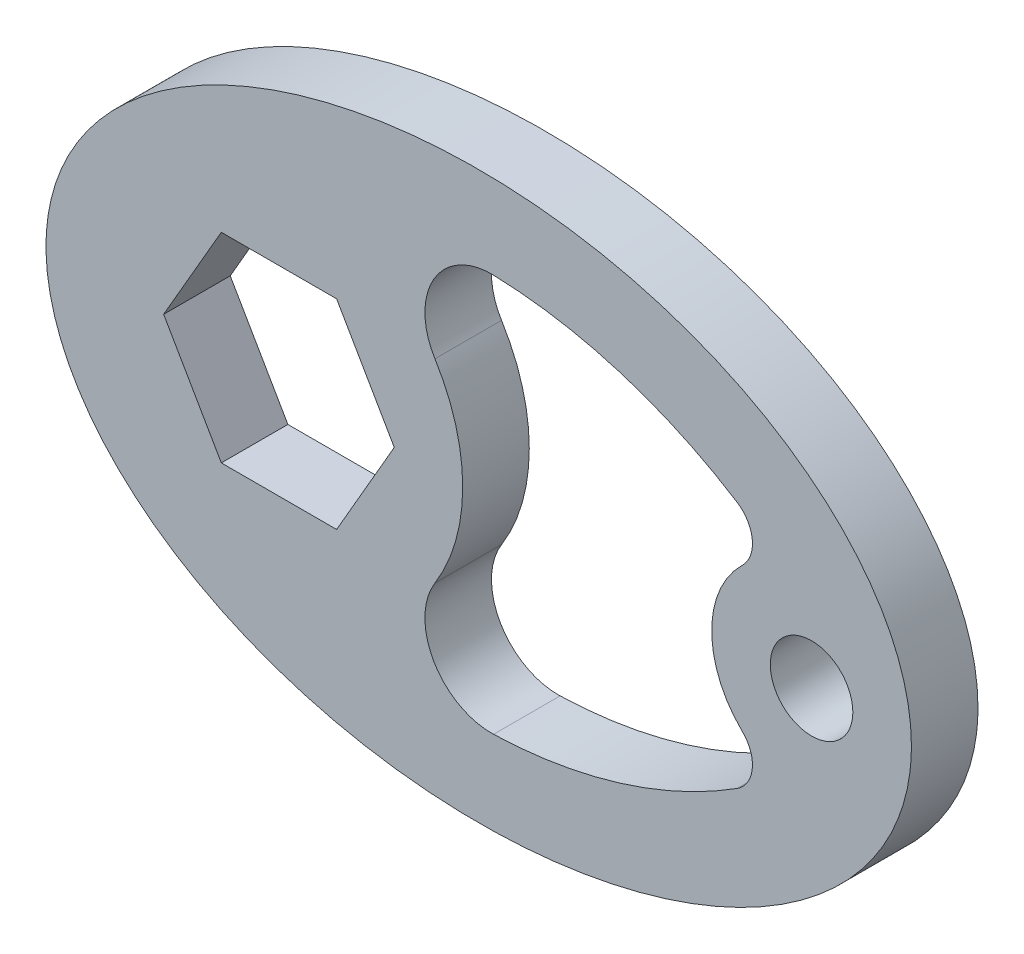
ISO-10303-21;
HEADER;
FILE_DESCRIPTION(('STEP AP214'),'2;1');
FILE_NAME('part.step','',(''),(''),'','','');
FILE_SCHEMA(('AUTOMOTIVE_DESIGN { 1 0 10303 214 1 1 1 1 }'));
ENDSEC;
DATA;
#1=APPLICATION_CONTEXT('core data for automotive mechanical design processes');
#2=APPLICATION_PROTOCOL_DEFINITION('international standard','automotive_design',2000,#1);
#3=PRODUCT_CONTEXT('',#1,'mechanical');
#4=PRODUCT('Part','Part','',(#3));
#5=PRODUCT_RELATED_PRODUCT_CATEGORY('part','',(#4));
#6=PRODUCT_DEFINITION_FORMATION('','',#4);
#7=PRODUCT_DEFINITION_CONTEXT('part definition',#1,'design');
#8=PRODUCT_DEFINITION('design','',#6,#7);
#9=PRODUCT_DEFINITION_SHAPE('','',#8);
#10=(LENGTH_UNIT() NAMED_UNIT(*) SI_UNIT(.MILLI.,.METRE.));
#11=(NAMED_UNIT(*) PLANE_ANGLE_UNIT() SI_UNIT($,.RADIAN.));
#12=(NAMED_UNIT(*) SI_UNIT($,.STERADIAN.) SOLID_ANGLE_UNIT());
#13=UNCERTAINTY_MEASURE_WITH_UNIT(LENGTH_MEASURE(1.E-05),#10,'distance_accuracy_value','');
#14=(GEOMETRIC_REPRESENTATION_CONTEXT(3) GLOBAL_UNCERTAINTY_ASSIGNED_CONTEXT((#13)) GLOBAL_UNIT_ASSIGNED_CONTEXT((#10,
#11,#12)) REPRESENTATION_CONTEXT('',''));
#15=CARTESIAN_POINT('',(0.,0.,0.));
#16=DIRECTION('',(0.,0.,1.));
#17=DIRECTION('',(1.,0.,0.));
#18=AXIS2_PLACEMENT_3D('',#15,#16,#17);
#19=CARTESIAN_POINT('',(0.,0.,12.7));
#20=DIRECTION('',(0.,0.,1.));
#21=DIRECTION('',(1.,0.,0.));
#22=AXIS2_PLACEMENT_3D('',#19,#20,#21);
#23=PLANE('',#22);
#24=CARTESIAN_POINT('',(0.,0.,12.7));
#25=DIRECTION('',(0.,0.,1.));
#26=DIRECTION('',(1.,0.,0.));
#27=AXIS2_PLACEMENT_3D('',#24,#25,#26);
#28=ELLIPSE('',#27,82.55,53.975);
#29=CARTESIAN_POINT('',(82.55,0.,12.7));
#30=VERTEX_POINT('',#29);
#31=EDGE_CURVE('E11',#30,#30,#28,.T.);
#32=ORIENTED_EDGE('',*,*,#31,.T.);
#33=EDGE_LOOP('',(#32));
#34=FACE_BOUND('',#33,.T.);
#35=CARTESIAN_POINT('',(63.5,0.,12.7));
#36=DIRECTION('',(0.,0.,1.));
#37=DIRECTION('',(1.,0.,0.));
#38=AXIS2_PLACEMENT_3D('',#35,#36,#37);
#39=CIRCLE('',#38,7.87399999999999);
#40=CARTESIAN_POINT('',(71.374,0.,12.7));
#41=VERTEX_POINT('',#40);
#42=EDGE_CURVE('E293',#41,#41,#39,.T.);
#43=ORIENTED_EDGE('',*,*,#42,.F.);
#44=EDGE_LOOP('',(#43));
#45=FACE_BOUND('',#44,.T.);
#46=DIRECTION('',(-0.5,0.866025403784439,0.));
#47=VECTOR('',#46,1.);
#48=CARTESIAN_POINT('',(-16.1029547438753,0.,12.7));
#49=LINE('',#48,#47);
#50=CARTESIAN_POINT('',(-16.1029547438753,0.,12.7));
#51=VERTEX_POINT('',#50);
#52=CARTESIAN_POINT('',(-27.1014773719376,19.05,12.7));
#53=VERTEX_POINT('',#52);
#54=EDGE_CURVE('E233',#51,#53,#49,.T.);
#55=ORIENTED_EDGE('',*,*,#54,.F.);
#56=DIRECTION('',(0.5,0.866025403784438,0.));
#57=VECTOR('',#56,1.);
#58=CARTESIAN_POINT('',(-27.1014773719376,-19.05,12.7));
#59=LINE('',#58,#57);
#60=CARTESIAN_POINT('',(-27.1014773719376,-19.05,12.7));
#61=VERTEX_POINT('',#60);
#62=EDGE_CURVE('E230',#61,#51,#59,.T.);
#63=ORIENTED_EDGE('',*,*,#62,.F.);
#64=DIRECTION('',(1.,0.,0.));
#65=VECTOR('',#64,1.);
#66=CARTESIAN_POINT('',(-49.0985226280624,-19.05,12.7));
#67=LINE('',#66,#65);
#68=CARTESIAN_POINT('',(-49.0985226280624,-19.05,12.7));
#69=VERTEX_POINT('',#68);
#70=EDGE_CURVE('E247',#69,#61,#67,.T.);
#71=ORIENTED_EDGE('',*,*,#70,.F.);
#72=DIRECTION('',(0.5,-0.866025403784439,0.));
#73=VECTOR('',#72,1.);
#74=CARTESIAN_POINT('',(-60.0970452561247,0.,12.7));
#75=LINE('',#74,#73);
#76=CARTESIAN_POINT('',(-60.0970452561247,0.,12.7));
#77=VERTEX_POINT('',#76);
#78=EDGE_CURVE('E243',#77,#69,#75,.T.);
#79=ORIENTED_EDGE('',*,*,#78,.F.);
#80=DIRECTION('',(-0.5,-0.866025403784439,0.));
#81=VECTOR('',#80,1.);
#82=CARTESIAN_POINT('',(-49.0985226280624,19.05,12.7));
#83=LINE('',#82,#81);
#84=CARTESIAN_POINT('',(-49.0985226280624,19.05,12.7));
#85=VERTEX_POINT('',#84);
#86=EDGE_CURVE('E240',#85,#77,#83,.T.);
#87=ORIENTED_EDGE('',*,*,#86,.F.);
#88=DIRECTION('',(-1.,0.,0.));
#89=VECTOR('',#88,1.);
#90=CARTESIAN_POINT('',(-27.1014773719376,19.05,12.7));
#91=LINE('',#90,#89);
#92=EDGE_CURVE('E237',#53,#85,#91,.T.);
#93=ORIENTED_EDGE('',*,*,#92,.F.);
#94=EDGE_LOOP('',(#55,#63,#71,#79,#87,#93));
#95=FACE_BOUND('',#94,.T.);
#96=CARTESIAN_POINT('',(-38.1,0.,12.7));
#97=DIRECTION('',(0.,0.,-1.));
#98=DIRECTION('',(1.,0.,0.));
#99=AXIS2_PLACEMENT_3D('',#96,#97,#98);
#100=CIRCLE('',#99,35.052);
#101=CARTESIAN_POINT('',(-8.34251415086992,18.5238964567076,12.7));
#102=VERTEX_POINT('',#101);
#103=CARTESIAN_POINT('',(-8.34251415086992,-18.5238964567076,12.7));
#104=VERTEX_POINT('',#103);
#105=EDGE_CURVE('E150',#102,#104,#100,.T.);
#106=ORIENTED_EDGE('',*,*,#105,.F.);
#107=CARTESIAN_POINT('',(2.43918362055402,25.2354531439205,12.7));
#108=DIRECTION('',(0.,0.,1.));
#109=DIRECTION('',(-1.,0.,0.));
#110=AXIS2_PLACEMENT_3D('',#107,#108,#109);
#111=CIRCLE('',#110,12.7);
#112=CARTESIAN_POINT('',(2.83007843154024,37.9294360195488,12.7));
#113=VERTEX_POINT('',#112);
#114=EDGE_CURVE('E141',#113,#102,#111,.T.);
#115=ORIENTED_EDGE('',*,*,#114,.F.);
#116=CARTESIAN_POINT('',(0.,-53.975,12.7));
#117=DIRECTION('',(0.,0.,1.));
#118=DIRECTION('',(1.,0.,0.));
#119=AXIS2_PLACEMENT_3D('',#116,#117,#118);
#120=CIRCLE('',#119,91.948);
#121=CARTESIAN_POINT('',(49.2795403107903,23.6520675135754,12.7));
#122=VERTEX_POINT('',#121);
#123=EDGE_CURVE('E182',#122,#113,#120,.T.);
#124=ORIENTED_EDGE('',*,*,#123,.F.);
#125=CARTESIAN_POINT('',(45.8762571401556,18.2910821880523,12.7));
#126=DIRECTION('',(0.,0.,1.));
#127=DIRECTION('',(1.,0.,0.));
#128=AXIS2_PLACEMENT_3D('',#125,#126,#127);
#129=CIRCLE('',#128,6.35);
#130=CARTESIAN_POINT('',(50.2821928551167,13.7183116410392,12.7));
#131=VERTEX_POINT('',#130);
#132=EDGE_CURVE('E179',#131,#122,#129,.T.);
#133=ORIENTED_EDGE('',*,*,#132,.F.);
#134=CARTESIAN_POINT('',(63.5,0.,12.7));
#135=DIRECTION('',(0.,0.,-1.));
#136=DIRECTION('',(1.,0.,0.));
#137=AXIS2_PLACEMENT_3D('',#134,#135,#136);
#138=CIRCLE('',#137,19.05);
#139=CARTESIAN_POINT('',(50.2821928551167,-13.7183116410392,12.7));
#140=VERTEX_POINT('',#139);
#141=EDGE_CURVE('E176',#140,#131,#138,.T.);
#142=ORIENTED_EDGE('',*,*,#141,.F.);
#143=CARTESIAN_POINT('',(45.8762571401556,-18.2910821880523,12.7));
#144=DIRECTION('',(0.,0.,1.));
#145=DIRECTION('',(-1.,0.,0.));
#146=AXIS2_PLACEMENT_3D('',#143,#144,#145);
#147=CIRCLE('',#146,6.35);
#148=CARTESIAN_POINT('',(49.2795403107903,-23.6520675135754,12.7));
#149=VERTEX_POINT('',#148);
#150=EDGE_CURVE('E173',#149,#140,#147,.T.);
#151=ORIENTED_EDGE('',*,*,#150,.F.);
#152=CARTESIAN_POINT('',(0.,53.975,12.7));
#153=DIRECTION('',(0.,0.,1.));
#154=DIRECTION('',(-1.,0.,0.));
#155=AXIS2_PLACEMENT_3D('',#152,#153,#154);
#156=CIRCLE('',#155,91.948);
#157=CARTESIAN_POINT('',(2.83007843154024,-37.9294360195488,12.7));
#158=VERTEX_POINT('',#157);
#159=EDGE_CURVE('E168',#158,#149,#156,.T.);
#160=ORIENTED_EDGE('',*,*,#159,.F.);
#161=CARTESIAN_POINT('',(2.43918362055402,-25.2354531439205,12.7));
#162=DIRECTION('',(0.,0.,1.));
#163=DIRECTION('',(1.,0.,0.));
#164=AXIS2_PLACEMENT_3D('',#161,#162,#163);
#165=CIRCLE('',#164,12.7);
#166=EDGE_CURVE('E164',#104,#158,#165,.T.);
#167=ORIENTED_EDGE('',*,*,#166,.F.);
#168=EDGE_LOOP('',(#106,#115,#124,#133,#142,#151,#160,#167));
#169=FACE_BOUND('',#168,.T.);
#170=ADVANCED_FACE('F39',(#34,#45,#95,#169),#23,.T.);
#171=CARTESIAN_POINT('',(0.,0.,0.));
#172=DIRECTION('',(0.,0.,1.));
#173=DIRECTION('',(1.,0.,0.));
#174=AXIS2_PLACEMENT_3D('',#171,#172,#173);
#175=PLANE('',#174);
#176=DIRECTION('',(0.5,0.866025403784438,0.));
#177=VECTOR('',#176,1.);
#178=CARTESIAN_POINT('',(-27.1014773719376,-19.05,0.));
#179=LINE('',#178,#177);
#180=CARTESIAN_POINT('',(-27.1014773719376,-19.05,0.));
#181=VERTEX_POINT('',#180);
#182=CARTESIAN_POINT('',(-16.1029547438753,0.,0.));
#183=VERTEX_POINT('',#182);
#184=EDGE_CURVE('E159',#181,#183,#179,.T.);
#185=ORIENTED_EDGE('',*,*,#184,.T.);
#186=DIRECTION('',(-0.5,0.866025403784439,0.));
#187=VECTOR('',#186,1.);
#188=CARTESIAN_POINT('',(-16.1029547438753,0.,0.));
#189=LINE('',#188,#187);
#190=CARTESIAN_POINT('',(-27.1014773719376,19.05,0.));
#191=VERTEX_POINT('',#190);
#192=EDGE_CURVE('E254',#183,#191,#189,.T.);
#193=ORIENTED_EDGE('',*,*,#192,.T.);
#194=DIRECTION('',(-1.,0.,0.));
#195=VECTOR('',#194,1.);
#196=CARTESIAN_POINT('',(-27.1014773719376,19.05,0.));
#197=LINE('',#196,#195);
#198=CARTESIAN_POINT('',(-49.0985226280624,19.05,0.));
#199=VERTEX_POINT('',#198);
#200=EDGE_CURVE('E258',#191,#199,#197,.T.);
#201=ORIENTED_EDGE('',*,*,#200,.T.);
#202=DIRECTION('',(-0.5,-0.866025403784439,0.));
#203=VECTOR('',#202,1.);
#204=CARTESIAN_POINT('',(-49.0985226280624,19.05,0.));
#205=LINE('',#204,#203);
#206=CARTESIAN_POINT('',(-60.0970452561247,0.,0.));
#207=VERTEX_POINT('',#206);
#208=EDGE_CURVE('E262',#199,#207,#205,.T.);
#209=ORIENTED_EDGE('',*,*,#208,.T.);
#210=DIRECTION('',(0.5,-0.866025403784439,0.));
#211=VECTOR('',#210,1.);
#212=CARTESIAN_POINT('',(-60.0970452561247,0.,0.));
#213=LINE('',#212,#211);
#214=CARTESIAN_POINT('',(-49.0985226280624,-19.05,0.));
#215=VERTEX_POINT('',#214);
#216=EDGE_CURVE('E266',#207,#215,#213,.T.);
#217=ORIENTED_EDGE('',*,*,#216,.T.);
#218=DIRECTION('',(1.,0.,0.));
#219=VECTOR('',#218,1.);
#220=CARTESIAN_POINT('',(-49.0985226280624,-19.05,0.));
#221=LINE('',#220,#219);
#222=EDGE_CURVE('E234',#215,#181,#221,.T.);
#223=ORIENTED_EDGE('',*,*,#222,.T.);
#224=EDGE_LOOP('',(#185,#193,#201,#209,#217,#223));
#225=FACE_BOUND('',#224,.T.);
#226=CARTESIAN_POINT('',(0.,0.,0.));
#227=DIRECTION('',(0.,0.,1.));
#228=DIRECTION('',(1.,0.,0.));
#229=AXIS2_PLACEMENT_3D('',#226,#227,#228);
#230=ELLIPSE('',#229,82.55,53.975);
#231=CARTESIAN_POINT('',(82.55,0.,0.));
#232=VERTEX_POINT('',#231);
#233=EDGE_CURVE('E44',#232,#232,#230,.T.);
#234=ORIENTED_EDGE('',*,*,#233,.F.);
#235=EDGE_LOOP('',(#234));
#236=FACE_BOUND('',#235,.T.);
#237=CARTESIAN_POINT('',(63.5,0.,0.));
#238=DIRECTION('',(0.,0.,1.));
#239=DIRECTION('',(1.,0.,0.));
#240=AXIS2_PLACEMENT_3D('',#237,#238,#239);
#241=CIRCLE('',#240,7.87399999999999);
#242=CARTESIAN_POINT('',(71.374,0.,0.));
#243=VERTEX_POINT('',#242);
#244=EDGE_CURVE('E292',#243,#243,#241,.T.);
#245=ORIENTED_EDGE('',*,*,#244,.T.);
#246=EDGE_LOOP('',(#245));
#247=FACE_BOUND('',#246,.T.);
#248=CARTESIAN_POINT('',(2.43918362055402,25.2354531439205,0.));
#249=DIRECTION('',(0.,0.,1.));
#250=DIRECTION('',(-1.,0.,0.));
#251=AXIS2_PLACEMENT_3D('',#248,#249,#250);
#252=CIRCLE('',#251,12.7);
#253=CARTESIAN_POINT('',(2.83007843154024,37.9294360195488,0.));
#254=VERTEX_POINT('',#253);
#255=CARTESIAN_POINT('',(-8.34251415086992,18.5238964567076,0.));
#256=VERTEX_POINT('',#255);
#257=EDGE_CURVE('E63',#254,#256,#252,.T.);
#258=ORIENTED_EDGE('',*,*,#257,.T.);
#259=CARTESIAN_POINT('',(-38.1,0.,0.));
#260=DIRECTION('',(0.,0.,-1.));
#261=DIRECTION('',(1.,0.,0.));
#262=AXIS2_PLACEMENT_3D('',#259,#260,#261);
#263=CIRCLE('',#262,35.052);
#264=CARTESIAN_POINT('',(-8.34251415086992,-18.5238964567076,0.));
#265=VERTEX_POINT('',#264);
#266=EDGE_CURVE('E157',#256,#265,#263,.T.);
#267=ORIENTED_EDGE('',*,*,#266,.T.);
#268=CARTESIAN_POINT('',(2.43918362055402,-25.2354531439205,0.));
#269=DIRECTION('',(0.,0.,1.));
#270=DIRECTION('',(1.,0.,0.));
#271=AXIS2_PLACEMENT_3D('',#268,#269,#270);
#272=CIRCLE('',#271,12.7);
#273=CARTESIAN_POINT('',(2.83007843154024,-37.9294360195488,0.));
#274=VERTEX_POINT('',#273);
#275=EDGE_CURVE('E189',#265,#274,#272,.T.);
#276=ORIENTED_EDGE('',*,*,#275,.T.);
#277=CARTESIAN_POINT('',(0.,53.975,0.));
#278=DIRECTION('',(0.,0.,1.));
#279=DIRECTION('',(-1.,0.,0.));
#280=AXIS2_PLACEMENT_3D('',#277,#278,#279);
#281=CIRCLE('',#280,91.948);
#282=CARTESIAN_POINT('',(49.2795403107903,-23.6520675135754,0.));
#283=VERTEX_POINT('',#282);
#284=EDGE_CURVE('E193',#274,#283,#281,.T.);
#285=ORIENTED_EDGE('',*,*,#284,.T.);
#286=CARTESIAN_POINT('',(45.8762571401556,-18.2910821880523,0.));
#287=DIRECTION('',(0.,0.,1.));
#288=DIRECTION('',(-1.,0.,0.));
#289=AXIS2_PLACEMENT_3D('',#286,#287,#288);
#290=CIRCLE('',#289,6.35);
#291=CARTESIAN_POINT('',(50.2821928551167,-13.7183116410392,0.));
#292=VERTEX_POINT('',#291);
#293=EDGE_CURVE('E197',#283,#292,#290,.T.);
#294=ORIENTED_EDGE('',*,*,#293,.T.);
#295=CARTESIAN_POINT('',(63.5,0.,0.));
#296=DIRECTION('',(0.,0.,-1.));
#297=DIRECTION('',(1.,0.,0.));
#298=AXIS2_PLACEMENT_3D('',#295,#296,#297);
#299=CIRCLE('',#298,19.05);
#300=CARTESIAN_POINT('',(50.2821928551167,13.7183116410392,0.));
#301=VERTEX_POINT('',#300);
#302=EDGE_CURVE('E201',#292,#301,#299,.T.);
#303=ORIENTED_EDGE('',*,*,#302,.T.);
#304=CARTESIAN_POINT('',(45.8762571401556,18.2910821880523,0.));
#305=DIRECTION('',(0.,0.,1.));
#306=DIRECTION('',(1.,0.,0.));
#307=AXIS2_PLACEMENT_3D('',#304,#305,#306);
#308=CIRCLE('',#307,6.35);
#309=CARTESIAN_POINT('',(49.2795403107903,23.6520675135754,0.));
#310=VERTEX_POINT('',#309);
#311=EDGE_CURVE('E205',#301,#310,#308,.T.);
#312=ORIENTED_EDGE('',*,*,#311,.T.);
#313=CARTESIAN_POINT('',(0.,-53.975,0.));
#314=DIRECTION('',(0.,0.,1.));
#315=DIRECTION('',(1.,0.,0.));
#316=AXIS2_PLACEMENT_3D('',#313,#314,#315);
#317=CIRCLE('',#316,91.948);
#318=EDGE_CURVE('E151',#310,#254,#317,.T.);
#319=ORIENTED_EDGE('',*,*,#318,.T.);
#320=EDGE_LOOP('',(#258,#267,#276,#285,#294,#303,#312,#319));
#321=FACE_BOUND('',#320,.T.);
#322=ADVANCED_FACE('F302',(#225,#236,#247,#321),#175,.F.);
#323=DIRECTION('',(0.,0.,-1.));
#324=VECTOR('',#323,1.);
#325=SURFACE_OF_LINEAR_EXTRUSION('',#28,#324);
#326=ORIENTED_EDGE('',*,*,#31,.F.);
#327=EDGE_LOOP('',(#326));
#328=FACE_BOUND('',#327,.T.);
#329=ORIENTED_EDGE('',*,*,#233,.T.);
#330=EDGE_LOOP('',(#329));
#331=FACE_BOUND('',#330,.T.);
#332=ADVANCED_FACE('F41',(#328,#331),#325,.F.);
#333=CARTESIAN_POINT('',(63.5,0.,12.7));
#334=DIRECTION('',(0.,0.,-1.));
#335=DIRECTION('',(-1.,0.,0.));
#336=AXIS2_PLACEMENT_3D('',#333,#334,#335);
#337=CYLINDRICAL_SURFACE('',#336,7.87399999999999);
#338=ORIENTED_EDGE('',*,*,#42,.T.);
#339=EDGE_LOOP('',(#338));
#340=FACE_BOUND('',#339,.T.);
#341=ORIENTED_EDGE('',*,*,#244,.F.);
#342=EDGE_LOOP('',(#341));
#343=FACE_BOUND('',#342,.T.);
#344=ADVANCED_FACE('F305',(#340,#343),#337,.F.);
#345=CARTESIAN_POINT('',(-27.1014773719376,-19.05,12.7));
#346=DIRECTION('',(-0.866025403784438,0.5,0.));
#347=DIRECTION('',(-0.5,-0.866025403784439,0.));
#348=AXIS2_PLACEMENT_3D('',#345,#346,#347);
#349=PLANE('',#348);
#350=ORIENTED_EDGE('',*,*,#184,.F.);
#351=DIRECTION('',(0.,0.,-1.));
#352=VECTOR('',#351,1.);
#353=CARTESIAN_POINT('',(-27.1014773719376,-19.05,12.7));
#354=LINE('',#353,#352);
#355=EDGE_CURVE('E250',#61,#181,#354,.T.);
#356=ORIENTED_EDGE('',*,*,#355,.F.);
#357=ORIENTED_EDGE('',*,*,#62,.T.);
#358=DIRECTION('',(0.,0.,-1.));
#359=VECTOR('',#358,1.);
#360=CARTESIAN_POINT('',(-16.1029547438753,0.,12.7));
#361=LINE('',#360,#359);
#362=EDGE_CURVE('E288',#51,#183,#361,.T.);
#363=ORIENTED_EDGE('',*,*,#362,.T.);
#364=EDGE_LOOP('',(#350,#356,#357,#363));
#365=FACE_BOUND('',#364,.T.);
#366=ADVANCED_FACE('F307',(#365),#349,.T.);
#367=CARTESIAN_POINT('',(-16.1029547438753,0.,12.7));
#368=DIRECTION('',(-0.866025403784439,-0.5,0.));
#369=DIRECTION('',(0.5,-0.866025403784439,0.));
#370=AXIS2_PLACEMENT_3D('',#367,#368,#369);
#371=PLANE('',#370);
#372=ORIENTED_EDGE('',*,*,#192,.F.);
#373=ORIENTED_EDGE('',*,*,#362,.F.);
#374=ORIENTED_EDGE('',*,*,#54,.T.);
#375=DIRECTION('',(0.,0.,-1.));
#376=VECTOR('',#375,1.);
#377=CARTESIAN_POINT('',(-27.1014773719376,19.05,12.7));
#378=LINE('',#377,#376);
#379=EDGE_CURVE('E285',#53,#191,#378,.T.);
#380=ORIENTED_EDGE('',*,*,#379,.T.);
#381=EDGE_LOOP('',(#372,#373,#374,#380));
#382=FACE_BOUND('',#381,.T.);
#383=ADVANCED_FACE('F314',(#382),#371,.T.);
#384=CARTESIAN_POINT('',(-27.1014773719376,19.05,12.7));
#385=DIRECTION('',(0.,-1.,0.));
#386=DIRECTION('',(0.,0.,-1.));
#387=AXIS2_PLACEMENT_3D('',#384,#385,#386);
#388=PLANE('',#387);
#389=ORIENTED_EDGE('',*,*,#200,.F.);
#390=ORIENTED_EDGE('',*,*,#379,.F.);
#391=ORIENTED_EDGE('',*,*,#92,.T.);
#392=DIRECTION('',(0.,0.,-1.));
#393=VECTOR('',#392,1.);
#394=CARTESIAN_POINT('',(-49.0985226280624,19.05,12.7));
#395=LINE('',#394,#393);
#396=EDGE_CURVE('E282',#85,#199,#395,.T.);
#397=ORIENTED_EDGE('',*,*,#396,.T.);
#398=EDGE_LOOP('',(#389,#390,#391,#397));
#399=FACE_BOUND('',#398,.T.);
#400=ADVANCED_FACE('F339',(#399),#388,.T.);
#401=CARTESIAN_POINT('',(-49.0985226280624,19.05,12.7));
#402=DIRECTION('',(0.866025403784439,-0.5,0.));
#403=DIRECTION('',(0.5,0.866025403784439,0.));
#404=AXIS2_PLACEMENT_3D('',#401,#402,#403);
#405=PLANE('',#404);
#406=ORIENTED_EDGE('',*,*,#208,.F.);
#407=ORIENTED_EDGE('',*,*,#396,.F.);
#408=ORIENTED_EDGE('',*,*,#86,.T.);
#409=DIRECTION('',(0.,0.,-1.));
#410=VECTOR('',#409,1.);
#411=CARTESIAN_POINT('',(-60.0970452561247,0.,12.7));
#412=LINE('',#411,#410);
#413=EDGE_CURVE('E279',#77,#207,#412,.T.);
#414=ORIENTED_EDGE('',*,*,#413,.T.);
#415=EDGE_LOOP('',(#406,#407,#408,#414));
#416=FACE_BOUND('',#415,.T.);
#417=ADVANCED_FACE('F353',(#416),#405,.T.);
#418=CARTESIAN_POINT('',(-60.0970452561247,0.,12.7));
#419=DIRECTION('',(0.866025403784439,0.5,0.));
#420=DIRECTION('',(-0.5,0.866025403784439,0.));
#421=AXIS2_PLACEMENT_3D('',#418,#419,#420);
#422=PLANE('',#421);
#423=ORIENTED_EDGE('',*,*,#216,.F.);
#424=ORIENTED_EDGE('',*,*,#413,.F.);
#425=ORIENTED_EDGE('',*,*,#78,.T.);
#426=DIRECTION('',(0.,0.,-1.));
#427=VECTOR('',#426,1.);
#428=CARTESIAN_POINT('',(-49.0985226280624,-19.05,12.7));
#429=LINE('',#428,#427);
#430=EDGE_CURVE('E276',#69,#215,#429,.T.);
#431=ORIENTED_EDGE('',*,*,#430,.T.);
#432=EDGE_LOOP('',(#423,#424,#425,#431));
#433=FACE_BOUND('',#432,.T.);
#434=ADVANCED_FACE('F350',(#433),#422,.T.);
#435=CARTESIAN_POINT('',(-49.0985226280624,-19.05,12.7));
#436=DIRECTION('',(0.,1.,0.));
#437=DIRECTION('',(0.,0.,1.));
#438=AXIS2_PLACEMENT_3D('',#435,#436,#437);
#439=PLANE('',#438);
#440=ORIENTED_EDGE('',*,*,#222,.F.);
#441=ORIENTED_EDGE('',*,*,#430,.F.);
#442=ORIENTED_EDGE('',*,*,#70,.T.);
#443=ORIENTED_EDGE('',*,*,#355,.T.);
#444=EDGE_LOOP('',(#440,#441,#442,#443));
#445=FACE_BOUND('',#444,.T.);
#446=ADVANCED_FACE('F346',(#445),#439,.T.);
#447=CARTESIAN_POINT('',(2.43918362055402,25.2354531439205,12.7));
#448=DIRECTION('',(0.,0.,-1.));
#449=DIRECTION('',(-1.,0.,0.));
#450=AXIS2_PLACEMENT_3D('',#447,#448,#449);
#451=CYLINDRICAL_SURFACE('',#450,12.7);
#452=ORIENTED_EDGE('',*,*,#257,.F.);
#453=DIRECTION('',(0.,0.,-1.));
#454=VECTOR('',#453,1.);
#455=CARTESIAN_POINT('',(2.83007843154024,37.9294360195488,12.7));
#456=LINE('',#455,#454);
#457=EDGE_CURVE('E145',#113,#254,#456,.T.);
#458=ORIENTED_EDGE('',*,*,#457,.F.);
#459=ORIENTED_EDGE('',*,*,#114,.T.);
#460=DIRECTION('',(0.,0.,-1.));
#461=VECTOR('',#460,1.);
#462=CARTESIAN_POINT('',(-8.34251415086992,18.5238964567076,12.7));
#463=LINE('',#462,#461);
#464=EDGE_CURVE('E144',#102,#256,#463,.T.);
#465=ORIENTED_EDGE('',*,*,#464,.T.);
#466=EDGE_LOOP('',(#452,#458,#459,#465));
#467=FACE_BOUND('',#466,.T.);
#468=ADVANCED_FACE('F143',(#467),#451,.F.);
#469=CARTESIAN_POINT('',(-38.1,0.,12.7));
#470=DIRECTION('',(0.,0.,-1.));
#471=DIRECTION('',(-1.,0.,0.));
#472=AXIS2_PLACEMENT_3D('',#469,#470,#471);
#473=CYLINDRICAL_SURFACE('',#472,35.052);
#474=ORIENTED_EDGE('',*,*,#266,.F.);
#475=ORIENTED_EDGE('',*,*,#464,.F.);
#476=ORIENTED_EDGE('',*,*,#105,.T.);
#477=DIRECTION('',(0.,0.,-1.));
#478=VECTOR('',#477,1.);
#479=CARTESIAN_POINT('',(-8.34251415086992,-18.5238964567076,12.7));
#480=LINE('',#479,#478);
#481=EDGE_CURVE('E160',#104,#265,#480,.T.);
#482=ORIENTED_EDGE('',*,*,#481,.T.);
#483=EDGE_LOOP('',(#474,#475,#476,#482));
#484=FACE_BOUND('',#483,.T.);
#485=ADVANCED_FACE('F154',(#484),#473,.T.);
#486=CARTESIAN_POINT('',(2.43918362055402,-25.2354531439205,12.7));
#487=DIRECTION('',(0.,0.,-1.));
#488=DIRECTION('',(-1.,0.,0.));
#489=AXIS2_PLACEMENT_3D('',#486,#487,#488);
#490=CYLINDRICAL_SURFACE('',#489,12.7);
#491=ORIENTED_EDGE('',*,*,#275,.F.);
#492=ORIENTED_EDGE('',*,*,#481,.F.);
#493=ORIENTED_EDGE('',*,*,#166,.T.);
#494=DIRECTION('',(0.,0.,-1.));
#495=VECTOR('',#494,1.);
#496=CARTESIAN_POINT('',(2.83007843154024,-37.9294360195488,12.7));
#497=LINE('',#496,#495);
#498=EDGE_CURVE('E225',#158,#274,#497,.T.);
#499=ORIENTED_EDGE('',*,*,#498,.T.);
#500=EDGE_LOOP('',(#491,#492,#493,#499));
#501=FACE_BOUND('',#500,.T.);
#502=ADVANCED_FACE('F407',(#501),#490,.F.);
#503=CARTESIAN_POINT('',(0.,53.975,12.7));
#504=DIRECTION('',(0.,0.,-1.));
#505=DIRECTION('',(-1.,0.,0.));
#506=AXIS2_PLACEMENT_3D('',#503,#504,#505);
#507=CYLINDRICAL_SURFACE('',#506,91.948);
#508=ORIENTED_EDGE('',*,*,#284,.F.);
#509=ORIENTED_EDGE('',*,*,#498,.F.);
#510=ORIENTED_EDGE('',*,*,#159,.T.);
#511=DIRECTION('',(0.,0.,-1.));
#512=VECTOR('',#511,1.);
#513=CARTESIAN_POINT('',(49.2795403107903,-23.6520675135754,12.7));
#514=LINE('',#513,#512);
#515=EDGE_CURVE('E222',#149,#283,#514,.T.);
#516=ORIENTED_EDGE('',*,*,#515,.T.);
#517=EDGE_LOOP('',(#508,#509,#510,#516));
#518=FACE_BOUND('',#517,.T.);
#519=ADVANCED_FACE('F416',(#518),#507,.F.);
#520=CARTESIAN_POINT('',(45.8762571401556,-18.2910821880523,12.7));
#521=DIRECTION('',(0.,0.,-1.));
#522=DIRECTION('',(-1.,0.,0.));
#523=AXIS2_PLACEMENT_3D('',#520,#521,#522);
#524=CYLINDRICAL_SURFACE('',#523,6.35);
#525=ORIENTED_EDGE('',*,*,#293,.F.);
#526=ORIENTED_EDGE('',*,*,#515,.F.);
#527=ORIENTED_EDGE('',*,*,#150,.T.);
#528=DIRECTION('',(0.,0.,-1.));
#529=VECTOR('',#528,1.);
#530=CARTESIAN_POINT('',(50.2821928551167,-13.7183116410392,12.7));
#531=LINE('',#530,#529);
#532=EDGE_CURVE('E219',#140,#292,#531,.T.);
#533=ORIENTED_EDGE('',*,*,#532,.T.);
#534=EDGE_LOOP('',(#525,#526,#527,#533));
#535=FACE_BOUND('',#534,.T.);
#536=ADVANCED_FACE('F426',(#535),#524,.F.);
#537=CARTESIAN_POINT('',(63.5,0.,12.7));
#538=DIRECTION('',(0.,0.,-1.));
#539=DIRECTION('',(-1.,0.,0.));
#540=AXIS2_PLACEMENT_3D('',#537,#538,#539);
#541=CYLINDRICAL_SURFACE('',#540,19.05);
#542=ORIENTED_EDGE('',*,*,#302,.F.);
#543=ORIENTED_EDGE('',*,*,#532,.F.);
#544=ORIENTED_EDGE('',*,*,#141,.T.);
#545=DIRECTION('',(0.,0.,-1.));
#546=VECTOR('',#545,1.);
#547=CARTESIAN_POINT('',(50.2821928551167,13.7183116410392,12.7));
#548=LINE('',#547,#546);
#549=EDGE_CURVE('E216',#131,#301,#548,.T.);
#550=ORIENTED_EDGE('',*,*,#549,.T.);
#551=EDGE_LOOP('',(#542,#543,#544,#550));
#552=FACE_BOUND('',#551,.T.);
#553=ADVANCED_FACE('F436',(#552),#541,.T.);
#554=CARTESIAN_POINT('',(45.8762571401556,18.2910821880523,12.7));
#555=DIRECTION('',(0.,0.,-1.));
#556=DIRECTION('',(-1.,0.,0.));
#557=AXIS2_PLACEMENT_3D('',#554,#555,#556);
#558=CYLINDRICAL_SURFACE('',#557,6.35);
#559=ORIENTED_EDGE('',*,*,#311,.F.);
#560=ORIENTED_EDGE('',*,*,#549,.F.);
#561=ORIENTED_EDGE('',*,*,#132,.T.);
#562=DIRECTION('',(0.,0.,-1.));
#563=VECTOR('',#562,1.);
#564=CARTESIAN_POINT('',(49.2795403107903,23.6520675135754,12.7));
#565=LINE('',#564,#563);
#566=EDGE_CURVE('E55',#122,#310,#565,.T.);
#567=ORIENTED_EDGE('',*,*,#566,.T.);
#568=EDGE_LOOP('',(#559,#560,#561,#567));
#569=FACE_BOUND('',#568,.T.);
#570=ADVANCED_FACE('F446',(#569),#558,.F.);
#571=CARTESIAN_POINT('',(0.,-53.975,12.7));
#572=DIRECTION('',(0.,0.,-1.));
#573=DIRECTION('',(-1.,0.,0.));
#574=AXIS2_PLACEMENT_3D('',#571,#572,#573);
#575=CYLINDRICAL_SURFACE('',#574,91.948);
#576=ORIENTED_EDGE('',*,*,#318,.F.);
#577=ORIENTED_EDGE('',*,*,#566,.F.);
#578=ORIENTED_EDGE('',*,*,#123,.T.);
#579=ORIENTED_EDGE('',*,*,#457,.T.);
#580=EDGE_LOOP('',(#576,#577,#578,#579));
#581=FACE_BOUND('',#580,.T.);
#582=ADVANCED_FACE('F456',(#581),#575,.F.);
#583=CLOSED_SHELL('',(#170,#322,#332,#344,#366,#383,#400,#417,#434,#446,#468,#485,#502,#519,
#536,#553,#570,#582));
#584=MANIFOLD_SOLID_BREP('B2',#583);
#585=ADVANCED_BREP_SHAPE_REPRESENTATION('',(#18,#584),#14);
#586=SHAPE_DEFINITION_REPRESENTATION(#9,#585);
ENDSEC;
END-ISO-10303-21;
